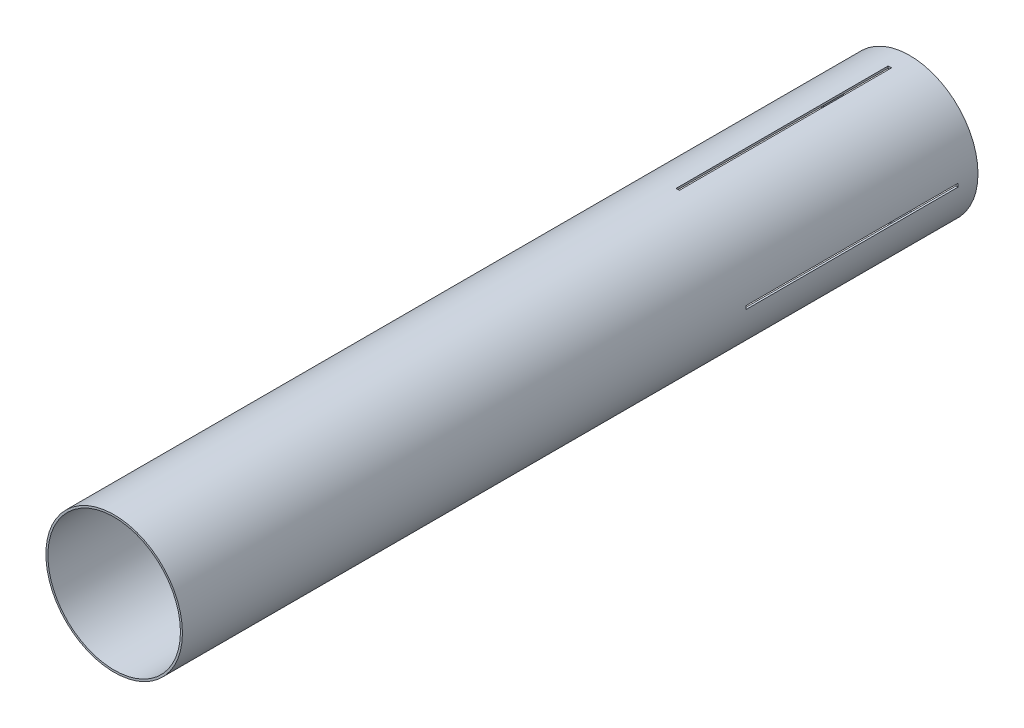
ISO-10303-21;
HEADER;
FILE_DESCRIPTION(('STEP AP214'),'2;1');
FILE_NAME('part.step','',(''),(''),'','','');
FILE_SCHEMA(('AUTOMOTIVE_DESIGN { 1 0 10303 214 1 1 1 1 }'));
ENDSEC;
DATA;
#1=APPLICATION_CONTEXT('core data for automotive mechanical design processes');
#2=APPLICATION_PROTOCOL_DEFINITION('international standard','automotive_design',2000,#1);
#3=PRODUCT_CONTEXT('',#1,'mechanical');
#4=PRODUCT('Part','Part','',(#3));
#5=PRODUCT_RELATED_PRODUCT_CATEGORY('part','',(#4));
#6=PRODUCT_DEFINITION_FORMATION('','',#4);
#7=PRODUCT_DEFINITION_CONTEXT('part definition',#1,'design');
#8=PRODUCT_DEFINITION('design','',#6,#7);
#9=PRODUCT_DEFINITION_SHAPE('','',#8);
#10=(LENGTH_UNIT() NAMED_UNIT(*) SI_UNIT(.MILLI.,.METRE.));
#11=(NAMED_UNIT(*) PLANE_ANGLE_UNIT() SI_UNIT($,.RADIAN.));
#12=(NAMED_UNIT(*) SI_UNIT($,.STERADIAN.) SOLID_ANGLE_UNIT());
#13=UNCERTAINTY_MEASURE_WITH_UNIT(LENGTH_MEASURE(1.E-05),#10,'distance_accuracy_value','');
#14=(GEOMETRIC_REPRESENTATION_CONTEXT(3) GLOBAL_UNCERTAINTY_ASSIGNED_CONTEXT((#13)) GLOBAL_UNIT_ASSIGNED_CONTEXT((#10,
#11,#12)) REPRESENTATION_CONTEXT('',''));
#15=CARTESIAN_POINT('',(0.,0.,0.));
#16=DIRECTION('',(0.,0.,1.));
#17=DIRECTION('',(1.,0.,0.));
#18=AXIS2_PLACEMENT_3D('',#15,#16,#17);
#19=CARTESIAN_POINT('',(0.,0.,381.));
#20=DIRECTION('',(0.,0.,-1.));
#21=DIRECTION('',(-1.,0.,0.));
#22=AXIS2_PLACEMENT_3D('',#19,#20,#21);
#23=CYLINDRICAL_SURFACE('',#22,65.405);
#24=CARTESIAN_POINT('',(0.,0.,-158.75));
#25=DIRECTION('',(0.,0.,-1.));
#26=DIRECTION('',(-1.,0.,0.));
#27=AXIS2_PLACEMENT_3D('',#24,#25,#26);
#28=CIRCLE('',#27,65.405);
#29=CARTESIAN_POINT('',(-65.3857313849895,-1.58750000000023,-158.75));
#30=VERTEX_POINT('',#29);
#31=CARTESIAN_POINT('',(-65.3857313849895,1.58749999999977,-158.75));
#32=VERTEX_POINT('',#31);
#33=EDGE_CURVE('E216',#30,#32,#28,.T.);
#34=ORIENTED_EDGE('',*,*,#33,.F.);
#35=DIRECTION('',(0.,0.,-1.));
#36=VECTOR('',#35,1.);
#37=CARTESIAN_POINT('',(-65.3857313849895,-1.58750000000023,381.));
#38=LINE('',#37,#36);
#39=CARTESIAN_POINT('',(-65.3857313849895,-1.58750000000022,-361.95));
#40=VERTEX_POINT('',#39);
#41=EDGE_CURVE('E239',#40,#30,#38,.F.);
#42=ORIENTED_EDGE('',*,*,#41,.F.);
#43=CARTESIAN_POINT('',(0.,0.,-361.95));
#44=DIRECTION('',(0.,0.,1.));
#45=DIRECTION('',(1.,0.,0.));
#46=AXIS2_PLACEMENT_3D('',#43,#44,#45);
#47=CIRCLE('',#46,65.405);
#48=CARTESIAN_POINT('',(-65.3857313849895,1.58749999999977,-361.95));
#49=VERTEX_POINT('',#48);
#50=EDGE_CURVE('E232',#49,#40,#47,.T.);
#51=ORIENTED_EDGE('',*,*,#50,.F.);
#52=DIRECTION('',(0.,0.,-1.));
#53=VECTOR('',#52,1.);
#54=CARTESIAN_POINT('',(-65.3857313849895,1.58749999999978,381.));
#55=LINE('',#54,#53);
#56=EDGE_CURVE('E236',#32,#49,#55,.T.);
#57=ORIENTED_EDGE('',*,*,#56,.F.);
#58=EDGE_LOOP('',(#34,#42,#51,#57));
#59=FACE_BOUND('',#58,.T.);
#60=CARTESIAN_POINT('',(1.5875,-65.3857313849895,-158.75));
#61=VERTEX_POINT('',#60);
#62=CARTESIAN_POINT('',(-1.5875,-65.3857313849895,-158.75));
#63=VERTEX_POINT('',#62);
#64=EDGE_CURVE('E240',#61,#63,#28,.T.);
#65=ORIENTED_EDGE('',*,*,#64,.F.);
#66=DIRECTION('',(0.,0.,-1.));
#67=VECTOR('',#66,1.);
#68=CARTESIAN_POINT('',(1.58750000000001,-65.3857313849895,381.));
#69=LINE('',#68,#67);
#70=CARTESIAN_POINT('',(1.58749999999999,-65.3857313849895,-361.95));
#71=VERTEX_POINT('',#70);
#72=EDGE_CURVE('E227',#71,#61,#69,.F.);
#73=ORIENTED_EDGE('',*,*,#72,.F.);
#74=CARTESIAN_POINT('',(-1.5875,-65.3857313849895,-361.95));
#75=VERTEX_POINT('',#74);
#76=EDGE_CURVE('E59',#75,#71,#47,.T.);
#77=ORIENTED_EDGE('',*,*,#76,.F.);
#78=DIRECTION('',(0.,0.,-1.));
#79=VECTOR('',#78,1.);
#80=CARTESIAN_POINT('',(-1.58750000000001,-65.3857313849895,381.));
#81=LINE('',#80,#79);
#82=EDGE_CURVE('E229',#63,#75,#81,.T.);
#83=ORIENTED_EDGE('',*,*,#82,.F.);
#84=EDGE_LOOP('',(#65,#73,#77,#83));
#85=FACE_BOUND('',#84,.T.);
#86=CARTESIAN_POINT('',(0.,0.,381.));
#87=DIRECTION('',(0.,0.,1.));
#88=DIRECTION('',(1.,0.,0.));
#89=AXIS2_PLACEMENT_3D('',#86,#87,#88);
#90=CIRCLE('',#89,65.405);
#91=CARTESIAN_POINT('',(65.405,0.,381.));
#92=VERTEX_POINT('',#91);
#93=EDGE_CURVE('E269',#92,#92,#90,.T.);
#94=ORIENTED_EDGE('',*,*,#93,.F.);
#95=EDGE_LOOP('',(#94));
#96=FACE_BOUND('',#95,.T.);
#97=CARTESIAN_POINT('',(0.,0.,-381.));
#98=DIRECTION('',(0.,0.,1.));
#99=DIRECTION('',(1.,0.,0.));
#100=AXIS2_PLACEMENT_3D('',#97,#98,#99);
#101=CIRCLE('',#100,65.405);
#102=CARTESIAN_POINT('',(65.405,0.,-381.));
#103=VERTEX_POINT('',#102);
#104=EDGE_CURVE('E266',#103,#103,#101,.T.);
#105=ORIENTED_EDGE('',*,*,#104,.T.);
#106=EDGE_LOOP('',(#105));
#107=FACE_BOUND('',#106,.T.);
#108=CARTESIAN_POINT('',(0.,0.,-361.95));
#109=DIRECTION('',(0.,0.,1.));
#110=DIRECTION('',(1.,0.,0.));
#111=AXIS2_PLACEMENT_3D('',#108,#109,#110);
#112=CIRCLE('',#111,65.405);
#113=CARTESIAN_POINT('',(1.5875,65.3857313849895,-361.95));
#114=VERTEX_POINT('',#113);
#115=CARTESIAN_POINT('',(-1.58749999999999,65.3857313849895,-361.95));
#116=VERTEX_POINT('',#115);
#117=EDGE_CURVE('E254',#114,#116,#112,.T.);
#118=ORIENTED_EDGE('',*,*,#117,.F.);
#119=DIRECTION('',(0.,0.,-1.));
#120=VECTOR('',#119,1.);
#121=CARTESIAN_POINT('',(1.58750000000001,65.3857313849895,381.));
#122=LINE('',#121,#120);
#123=CARTESIAN_POINT('',(1.5875,65.3857313849895,-158.75));
#124=VERTEX_POINT('',#123);
#125=EDGE_CURVE('E256',#124,#114,#122,.T.);
#126=ORIENTED_EDGE('',*,*,#125,.F.);
#127=CARTESIAN_POINT('',(0.,0.,-158.75));
#128=DIRECTION('',(0.,0.,-1.));
#129=DIRECTION('',(-1.,0.,0.));
#130=AXIS2_PLACEMENT_3D('',#127,#128,#129);
#131=CIRCLE('',#130,65.405);
#132=CARTESIAN_POINT('',(-1.5875,65.3857313849895,-158.75));
#133=VERTEX_POINT('',#132);
#134=EDGE_CURVE('E258',#133,#124,#131,.T.);
#135=ORIENTED_EDGE('',*,*,#134,.F.);
#136=DIRECTION('',(0.,0.,-1.));
#137=VECTOR('',#136,1.);
#138=CARTESIAN_POINT('',(-1.58750000000001,65.3857313849895,381.));
#139=LINE('',#138,#137);
#140=EDGE_CURVE('E260',#116,#133,#139,.F.);
#141=ORIENTED_EDGE('',*,*,#140,.F.);
#142=EDGE_LOOP('',(#118,#126,#135,#141));
#143=FACE_BOUND('',#142,.T.);
#144=CARTESIAN_POINT('',(65.3857313849895,1.58750000000023,-158.75));
#145=VERTEX_POINT('',#144);
#146=CARTESIAN_POINT('',(65.3857313849895,-1.58749999999932,-158.75));
#147=VERTEX_POINT('',#146);
#148=EDGE_CURVE('E67',#145,#147,#28,.T.);
#149=ORIENTED_EDGE('',*,*,#148,.F.);
#150=DIRECTION('',(0.,0.,-1.));
#151=VECTOR('',#150,1.);
#152=CARTESIAN_POINT('',(65.3857313849895,1.58750000000024,381.));
#153=LINE('',#152,#151);
#154=CARTESIAN_POINT('',(65.3857313849895,1.58750000000023,-361.95));
#155=VERTEX_POINT('',#154);
#156=EDGE_CURVE('E234',#155,#145,#153,.F.);
#157=ORIENTED_EDGE('',*,*,#156,.F.);
#158=CARTESIAN_POINT('',(65.3857313849895,-1.58749999999932,-361.95));
#159=VERTEX_POINT('',#158);
#160=EDGE_CURVE('E231',#159,#155,#47,.T.);
#161=ORIENTED_EDGE('',*,*,#160,.F.);
#162=DIRECTION('',(0.,0.,-1.));
#163=VECTOR('',#162,1.);
#164=CARTESIAN_POINT('',(65.3857313849895,-1.58749999999932,381.));
#165=LINE('',#164,#163);
#166=EDGE_CURVE('E220',#147,#159,#165,.T.);
#167=ORIENTED_EDGE('',*,*,#166,.F.);
#168=EDGE_LOOP('',(#149,#157,#161,#167));
#169=FACE_BOUND('',#168,.T.);
#170=ADVANCED_FACE('F45',(#59,#85,#96,#107,#143,#169),#23,.T.);
#171=CARTESIAN_POINT('',(0.,0.,381.));
#172=DIRECTION('',(0.,0.,-1.));
#173=DIRECTION('',(-1.,0.,0.));
#174=AXIS2_PLACEMENT_3D('',#171,#172,#173);
#175=CYLINDRICAL_SURFACE('',#174,63.5);
#176=CARTESIAN_POINT('',(0.,0.,381.));
#177=DIRECTION('',(0.,0.,1.));
#178=DIRECTION('',(1.,0.,0.));
#179=AXIS2_PLACEMENT_3D('',#176,#177,#178);
#180=CIRCLE('',#179,63.5);
#181=CARTESIAN_POINT('',(63.5,0.,381.));
#182=VERTEX_POINT('',#181);
#183=EDGE_CURVE('E263',#182,#182,#180,.T.);
#184=ORIENTED_EDGE('',*,*,#183,.T.);
#185=EDGE_LOOP('',(#184));
#186=FACE_BOUND('',#185,.T.);
#187=CARTESIAN_POINT('',(0.,0.,-381.));
#188=DIRECTION('',(0.,0.,1.));
#189=DIRECTION('',(1.,0.,0.));
#190=AXIS2_PLACEMENT_3D('',#187,#188,#189);
#191=CIRCLE('',#190,63.5);
#192=CARTESIAN_POINT('',(63.5,0.,-381.));
#193=VERTEX_POINT('',#192);
#194=EDGE_CURVE('E262',#193,#193,#191,.T.);
#195=ORIENTED_EDGE('',*,*,#194,.F.);
#196=EDGE_LOOP('',(#195));
#197=FACE_BOUND('',#196,.T.);
#198=CARTESIAN_POINT('',(0.,0.,-361.95));
#199=DIRECTION('',(0.,0.,1.));
#200=DIRECTION('',(1.,0.,0.));
#201=AXIS2_PLACEMENT_3D('',#198,#199,#200);
#202=CIRCLE('',#201,63.5);
#203=CARTESIAN_POINT('',(1.5875,63.4801531484448,-361.95));
#204=VERTEX_POINT('',#203);
#205=CARTESIAN_POINT('',(-1.58749999999999,63.4801531484448,-361.95));
#206=VERTEX_POINT('',#205);
#207=EDGE_CURVE('E272',#204,#206,#202,.T.);
#208=ORIENTED_EDGE('',*,*,#207,.T.);
#209=DIRECTION('',(0.,0.,-1.));
#210=VECTOR('',#209,1.);
#211=CARTESIAN_POINT('',(-1.58750000000001,63.4801531484448,381.));
#212=LINE('',#211,#210);
#213=CARTESIAN_POINT('',(-1.5875,63.4801531484448,-158.75));
#214=VERTEX_POINT('',#213);
#215=EDGE_CURVE('E172',#206,#214,#212,.F.);
#216=ORIENTED_EDGE('',*,*,#215,.T.);
#217=CARTESIAN_POINT('',(0.,0.,-158.75));
#218=DIRECTION('',(0.,0.,-1.));
#219=DIRECTION('',(-1.,0.,0.));
#220=AXIS2_PLACEMENT_3D('',#217,#218,#219);
#221=CIRCLE('',#220,63.5);
#222=CARTESIAN_POINT('',(1.5875,63.4801531484448,-158.75));
#223=VERTEX_POINT('',#222);
#224=EDGE_CURVE('E280',#214,#223,#221,.T.);
#225=ORIENTED_EDGE('',*,*,#224,.T.);
#226=DIRECTION('',(0.,0.,-1.));
#227=VECTOR('',#226,1.);
#228=CARTESIAN_POINT('',(1.58750000000001,63.4801531484448,381.));
#229=LINE('',#228,#227);
#230=EDGE_CURVE('E277',#223,#204,#229,.T.);
#231=ORIENTED_EDGE('',*,*,#230,.T.);
#232=EDGE_LOOP('',(#208,#216,#225,#231));
#233=FACE_BOUND('',#232,.T.);
#234=DIRECTION('',(0.,0.,-1.));
#235=VECTOR('',#234,1.);
#236=CARTESIAN_POINT('',(63.4801531484448,1.58750000000023,381.));
#237=LINE('',#236,#235);
#238=CARTESIAN_POINT('',(63.4801531484448,1.58750000000022,-361.95));
#239=VERTEX_POINT('',#238);
#240=CARTESIAN_POINT('',(63.4801531484448,1.58750000000022,-158.75));
#241=VERTEX_POINT('',#240);
#242=EDGE_CURVE('E182',#239,#241,#237,.F.);
#243=ORIENTED_EDGE('',*,*,#242,.T.);
#244=CARTESIAN_POINT('',(0.,0.,-158.75));
#245=DIRECTION('',(0.,0.,-1.));
#246=DIRECTION('',(-1.,0.,0.));
#247=AXIS2_PLACEMENT_3D('',#244,#245,#246);
#248=CIRCLE('',#247,63.5);
#249=CARTESIAN_POINT('',(63.4801531484448,-1.58749999999934,-158.75));
#250=VERTEX_POINT('',#249);
#251=EDGE_CURVE('E175',#241,#250,#248,.T.);
#252=ORIENTED_EDGE('',*,*,#251,.T.);
#253=DIRECTION('',(0.,0.,-1.));
#254=VECTOR('',#253,1.);
#255=CARTESIAN_POINT('',(63.4801531484448,-1.58749999999934,381.));
#256=LINE('',#255,#254);
#257=CARTESIAN_POINT('',(63.4801531484448,-1.58749999999934,-361.95));
#258=VERTEX_POINT('',#257);
#259=EDGE_CURVE('E160',#250,#258,#256,.T.);
#260=ORIENTED_EDGE('',*,*,#259,.T.);
#261=CARTESIAN_POINT('',(0.,0.,-361.95));
#262=DIRECTION('',(0.,0.,1.));
#263=DIRECTION('',(1.,0.,0.));
#264=AXIS2_PLACEMENT_3D('',#261,#262,#263);
#265=CIRCLE('',#264,63.5);
#266=EDGE_CURVE('E171',#258,#239,#265,.T.);
#267=ORIENTED_EDGE('',*,*,#266,.T.);
#268=EDGE_LOOP('',(#243,#252,#260,#267));
#269=FACE_BOUND('',#268,.T.);
#270=CARTESIAN_POINT('',(1.58750000000001,-63.4801531484448,-158.75));
#271=VERTEX_POINT('',#270);
#272=CARTESIAN_POINT('',(-1.5875,-63.4801531484448,-158.75));
#273=VERTEX_POINT('',#272);
#274=EDGE_CURVE('E185',#271,#273,#248,.T.);
#275=ORIENTED_EDGE('',*,*,#274,.T.);
#276=DIRECTION('',(0.,0.,-1.));
#277=VECTOR('',#276,1.);
#278=CARTESIAN_POINT('',(-1.58750000000001,-63.4801531484448,381.));
#279=LINE('',#278,#277);
#280=CARTESIAN_POINT('',(-1.5875,-63.4801531484448,-361.95));
#281=VERTEX_POINT('',#280);
#282=EDGE_CURVE('E193',#273,#281,#279,.T.);
#283=ORIENTED_EDGE('',*,*,#282,.T.);
#284=CARTESIAN_POINT('',(1.58749999999999,-63.4801531484448,-361.95));
#285=VERTEX_POINT('',#284);
#286=EDGE_CURVE('E187',#281,#285,#265,.T.);
#287=ORIENTED_EDGE('',*,*,#286,.T.);
#288=DIRECTION('',(0.,0.,-1.));
#289=VECTOR('',#288,1.);
#290=CARTESIAN_POINT('',(1.58750000000001,-63.4801531484448,381.));
#291=LINE('',#290,#289);
#292=EDGE_CURVE('E183',#285,#271,#291,.F.);
#293=ORIENTED_EDGE('',*,*,#292,.T.);
#294=EDGE_LOOP('',(#275,#283,#287,#293));
#295=FACE_BOUND('',#294,.T.);
#296=CARTESIAN_POINT('',(-63.4801531484448,1.58749999999978,-361.95));
#297=VERTEX_POINT('',#296);
#298=CARTESIAN_POINT('',(-63.4801531484448,-1.58750000000022,-361.95));
#299=VERTEX_POINT('',#298);
#300=EDGE_CURVE('E196',#297,#299,#265,.T.);
#301=ORIENTED_EDGE('',*,*,#300,.T.);
#302=DIRECTION('',(0.,0.,-1.));
#303=VECTOR('',#302,1.);
#304=CARTESIAN_POINT('',(-63.4801531484448,-1.58750000000023,381.));
#305=LINE('',#304,#303);
#306=CARTESIAN_POINT('',(-63.4801531484448,-1.58750000000022,-158.75));
#307=VERTEX_POINT('',#306);
#308=EDGE_CURVE('E11',#299,#307,#305,.F.);
#309=ORIENTED_EDGE('',*,*,#308,.T.);
#310=CARTESIAN_POINT('',(-63.4801531484448,1.58749999999978,-158.75));
#311=VERTEX_POINT('',#310);
#312=EDGE_CURVE('E52',#307,#311,#248,.T.);
#313=ORIENTED_EDGE('',*,*,#312,.T.);
#314=DIRECTION('',(0.,0.,-1.));
#315=VECTOR('',#314,1.);
#316=CARTESIAN_POINT('',(-63.4801531484448,1.58749999999978,381.));
#317=LINE('',#316,#315);
#318=EDGE_CURVE('E191',#311,#297,#317,.T.);
#319=ORIENTED_EDGE('',*,*,#318,.T.);
#320=EDGE_LOOP('',(#301,#309,#313,#319));
#321=FACE_BOUND('',#320,.T.);
#322=ADVANCED_FACE('F180',(#186,#197,#233,#269,#295,#321),#175,.F.);
#323=CARTESIAN_POINT('',(0.,0.,381.));
#324=DIRECTION('',(0.,0.,1.));
#325=DIRECTION('',(1.,0.,0.));
#326=AXIS2_PLACEMENT_3D('',#323,#324,#325);
#327=PLANE('',#326);
#328=ORIENTED_EDGE('',*,*,#93,.T.);
#329=EDGE_LOOP('',(#328));
#330=FACE_BOUND('',#329,.T.);
#331=ORIENTED_EDGE('',*,*,#183,.F.);
#332=EDGE_LOOP('',(#331));
#333=FACE_BOUND('',#332,.T.);
#334=ADVANCED_FACE('F320',(#330,#333),#327,.T.);
#335=CARTESIAN_POINT('',(0.,0.,-381.));
#336=DIRECTION('',(0.,0.,1.));
#337=DIRECTION('',(1.,0.,0.));
#338=AXIS2_PLACEMENT_3D('',#335,#336,#337);
#339=PLANE('',#338);
#340=ORIENTED_EDGE('',*,*,#104,.F.);
#341=EDGE_LOOP('',(#340));
#342=FACE_BOUND('',#341,.T.);
#343=ORIENTED_EDGE('',*,*,#194,.T.);
#344=EDGE_LOOP('',(#343));
#345=FACE_BOUND('',#344,.T.);
#346=ADVANCED_FACE('F333',(#342,#345),#339,.F.);
#347=CARTESIAN_POINT('',(-1.5875,65.405,-158.75));
#348=DIRECTION('',(1.,0.,0.));
#349=DIRECTION('',(0.,0.,-1.));
#350=AXIS2_PLACEMENT_3D('',#347,#348,#349);
#351=PLANE('',#350);
#352=ORIENTED_EDGE('',*,*,#140,.T.);
#353=DIRECTION('',(0.,-1.,0.));
#354=VECTOR('',#353,1.);
#355=CARTESIAN_POINT('',(-1.5875,65.405,-158.75));
#356=LINE('',#355,#354);
#357=EDGE_CURVE('E251',#133,#214,#356,.T.);
#358=ORIENTED_EDGE('',*,*,#357,.T.);
#359=ORIENTED_EDGE('',*,*,#215,.F.);
#360=DIRECTION('',(0.,-1.,0.));
#361=VECTOR('',#360,1.);
#362=CARTESIAN_POINT('',(-1.58749999999999,65.405,-361.95));
#363=LINE('',#362,#361);
#364=EDGE_CURVE('E243',#116,#206,#363,.T.);
#365=ORIENTED_EDGE('',*,*,#364,.F.);
#366=EDGE_LOOP('',(#352,#358,#359,#365));
#367=FACE_BOUND('',#366,.T.);
#368=ADVANCED_FACE('F288',(#367),#351,.T.);
#369=CARTESIAN_POINT('',(1.5875,65.405,-158.75));
#370=DIRECTION('',(0.,0.,-1.));
#371=DIRECTION('',(-1.,0.,0.));
#372=AXIS2_PLACEMENT_3D('',#369,#370,#371);
#373=PLANE('',#372);
#374=ORIENTED_EDGE('',*,*,#134,.T.);
#375=DIRECTION('',(0.,-1.,0.));
#376=VECTOR('',#375,1.);
#377=CARTESIAN_POINT('',(1.5875,65.405,-158.75));
#378=LINE('',#377,#376);
#379=EDGE_CURVE('E248',#124,#223,#378,.T.);
#380=ORIENTED_EDGE('',*,*,#379,.T.);
#381=ORIENTED_EDGE('',*,*,#224,.F.);
#382=ORIENTED_EDGE('',*,*,#357,.F.);
#383=EDGE_LOOP('',(#374,#380,#381,#382));
#384=FACE_BOUND('',#383,.T.);
#385=ADVANCED_FACE('F293',(#384),#373,.T.);
#386=CARTESIAN_POINT('',(1.5875,65.405,-158.75));
#387=DIRECTION('',(-1.,0.,0.));
#388=DIRECTION('',(0.,0.,1.));
#389=AXIS2_PLACEMENT_3D('',#386,#387,#388);
#390=PLANE('',#389);
#391=ORIENTED_EDGE('',*,*,#125,.T.);
#392=DIRECTION('',(0.,-1.,0.));
#393=VECTOR('',#392,1.);
#394=CARTESIAN_POINT('',(1.5875,65.405,-361.95));
#395=LINE('',#394,#393);
#396=EDGE_CURVE('E245',#114,#204,#395,.T.);
#397=ORIENTED_EDGE('',*,*,#396,.T.);
#398=ORIENTED_EDGE('',*,*,#230,.F.);
#399=ORIENTED_EDGE('',*,*,#379,.F.);
#400=EDGE_LOOP('',(#391,#397,#398,#399));
#401=FACE_BOUND('',#400,.T.);
#402=ADVANCED_FACE('F301',(#401),#390,.T.);
#403=CARTESIAN_POINT('',(1.5875,65.405,-361.95));
#404=DIRECTION('',(0.,0.,1.));
#405=DIRECTION('',(1.,0.,0.));
#406=AXIS2_PLACEMENT_3D('',#403,#404,#405);
#407=PLANE('',#406);
#408=ORIENTED_EDGE('',*,*,#117,.T.);
#409=ORIENTED_EDGE('',*,*,#364,.T.);
#410=ORIENTED_EDGE('',*,*,#207,.F.);
#411=ORIENTED_EDGE('',*,*,#396,.F.);
#412=EDGE_LOOP('',(#408,#409,#410,#411));
#413=FACE_BOUND('',#412,.T.);
#414=ADVANCED_FACE('F303',(#413),#407,.T.);
#415=CARTESIAN_POINT('',(65.4050000000007,-1.58749999999932,-158.75));
#416=DIRECTION('',(0.,1.,0.));
#417=DIRECTION('',(-1.,0.,0.));
#418=AXIS2_PLACEMENT_3D('',#415,#416,#417);
#419=PLANE('',#418);
#420=ORIENTED_EDGE('',*,*,#166,.T.);
#421=DIRECTION('',(-1.,0.,0.));
#422=VECTOR('',#421,1.);
#423=CARTESIAN_POINT('',(65.4050000000007,-1.58749999999932,-361.95));
#424=LINE('',#423,#422);
#425=EDGE_CURVE('E166',#159,#258,#424,.T.);
#426=ORIENTED_EDGE('',*,*,#425,.T.);
#427=ORIENTED_EDGE('',*,*,#259,.F.);
#428=DIRECTION('',(-1.,0.,0.));
#429=VECTOR('',#428,1.);
#430=CARTESIAN_POINT('',(65.4050000000007,-1.58749999999932,-158.75));
#431=LINE('',#430,#429);
#432=EDGE_CURVE('E163',#147,#250,#431,.T.);
#433=ORIENTED_EDGE('',*,*,#432,.F.);
#434=EDGE_LOOP('',(#420,#426,#427,#433));
#435=FACE_BOUND('',#434,.T.);
#436=ADVANCED_FACE('F162',(#435),#419,.T.);
#437=CARTESIAN_POINT('',(-65.4050000000002,1.58749999999977,-361.95));
#438=DIRECTION('',(0.,0.,1.));
#439=DIRECTION('',(1.,0.,0.));
#440=AXIS2_PLACEMENT_3D('',#437,#438,#439);
#441=PLANE('',#440);
#442=ORIENTED_EDGE('',*,*,#160,.T.);
#443=DIRECTION('',(1.,0.,0.));
#444=VECTOR('',#443,1.);
#445=CARTESIAN_POINT('',(-65.4050000000002,1.58749999999977,-361.95));
#446=LINE('',#445,#444);
#447=EDGE_CURVE('E223',#239,#155,#446,.T.);
#448=ORIENTED_EDGE('',*,*,#447,.F.);
#449=ORIENTED_EDGE('',*,*,#266,.F.);
#450=ORIENTED_EDGE('',*,*,#425,.F.);
#451=EDGE_LOOP('',(#442,#448,#449,#450));
#452=FACE_BOUND('',#451,.T.);
#453=ADVANCED_FACE('F311',(#452),#441,.T.);
#454=CARTESIAN_POINT('',(-65.4050000000002,1.58749999999977,-158.75));
#455=DIRECTION('',(0.,-1.,0.));
#456=DIRECTION('',(1.,0.,0.));
#457=AXIS2_PLACEMENT_3D('',#454,#455,#456);
#458=PLANE('',#457);
#459=ORIENTED_EDGE('',*,*,#156,.T.);
#460=DIRECTION('',(1.,0.,0.));
#461=VECTOR('',#460,1.);
#462=CARTESIAN_POINT('',(-65.4050000000002,1.58749999999977,-158.75));
#463=LINE('',#462,#461);
#464=EDGE_CURVE('E218',#241,#145,#463,.T.);
#465=ORIENTED_EDGE('',*,*,#464,.F.);
#466=ORIENTED_EDGE('',*,*,#242,.F.);
#467=ORIENTED_EDGE('',*,*,#447,.T.);
#468=EDGE_LOOP('',(#459,#465,#466,#467));
#469=FACE_BOUND('',#468,.T.);
#470=ADVANCED_FACE('F391',(#469),#458,.T.);
#471=CARTESIAN_POINT('',(-65.4050000000002,1.58749999999977,-158.75));
#472=DIRECTION('',(0.,0.,-1.));
#473=DIRECTION('',(-1.,0.,0.));
#474=AXIS2_PLACEMENT_3D('',#471,#472,#473);
#475=PLANE('',#474);
#476=ORIENTED_EDGE('',*,*,#148,.T.);
#477=ORIENTED_EDGE('',*,*,#432,.T.);
#478=ORIENTED_EDGE('',*,*,#251,.F.);
#479=ORIENTED_EDGE('',*,*,#464,.T.);
#480=EDGE_LOOP('',(#476,#477,#478,#479));
#481=FACE_BOUND('',#480,.T.);
#482=ADVANCED_FACE('F174',(#481),#475,.T.);
#483=CARTESIAN_POINT('',(1.5875,-65.405,-158.75));
#484=DIRECTION('',(-1.,0.,0.));
#485=DIRECTION('',(0.,0.,1.));
#486=AXIS2_PLACEMENT_3D('',#483,#484,#485);
#487=PLANE('',#486);
#488=ORIENTED_EDGE('',*,*,#72,.T.);
#489=DIRECTION('',(0.,1.,0.));
#490=VECTOR('',#489,1.);
#491=CARTESIAN_POINT('',(1.5875,-65.405,-158.75));
#492=LINE('',#491,#490);
#493=EDGE_CURVE('E527',#61,#271,#492,.T.);
#494=ORIENTED_EDGE('',*,*,#493,.T.);
#495=ORIENTED_EDGE('',*,*,#292,.F.);
#496=DIRECTION('',(0.,1.,0.));
#497=VECTOR('',#496,1.);
#498=CARTESIAN_POINT('',(1.58749999999999,-65.405,-361.95));
#499=LINE('',#498,#497);
#500=EDGE_CURVE('E177',#71,#285,#499,.T.);
#501=ORIENTED_EDGE('',*,*,#500,.F.);
#502=EDGE_LOOP('',(#488,#494,#495,#501));
#503=FACE_BOUND('',#502,.T.);
#504=ADVANCED_FACE('F421',(#503),#487,.T.);
#505=CARTESIAN_POINT('',(-1.5875,-65.405,-158.75));
#506=DIRECTION('',(1.,0.,0.));
#507=DIRECTION('',(0.,0.,-1.));
#508=AXIS2_PLACEMENT_3D('',#505,#506,#507);
#509=PLANE('',#508);
#510=ORIENTED_EDGE('',*,*,#82,.T.);
#511=DIRECTION('',(0.,1.,0.));
#512=VECTOR('',#511,1.);
#513=CARTESIAN_POINT('',(-1.5875,-65.405,-361.95));
#514=LINE('',#513,#512);
#515=EDGE_CURVE('E534',#75,#281,#514,.T.);
#516=ORIENTED_EDGE('',*,*,#515,.T.);
#517=ORIENTED_EDGE('',*,*,#282,.F.);
#518=DIRECTION('',(0.,1.,0.));
#519=VECTOR('',#518,1.);
#520=CARTESIAN_POINT('',(-1.5875,-65.405,-158.75));
#521=LINE('',#520,#519);
#522=EDGE_CURVE('E529',#63,#273,#521,.T.);
#523=ORIENTED_EDGE('',*,*,#522,.F.);
#524=EDGE_LOOP('',(#510,#516,#517,#523));
#525=FACE_BOUND('',#524,.T.);
#526=ADVANCED_FACE('F437',(#525),#509,.T.);
#527=ORIENTED_EDGE('',*,*,#76,.T.);
#528=ORIENTED_EDGE('',*,*,#500,.T.);
#529=ORIENTED_EDGE('',*,*,#286,.F.);
#530=ORIENTED_EDGE('',*,*,#515,.F.);
#531=EDGE_LOOP('',(#527,#528,#529,#530));
#532=FACE_BOUND('',#531,.T.);
#533=ADVANCED_FACE('F395',(#532),#441,.T.);
#534=ORIENTED_EDGE('',*,*,#64,.T.);
#535=ORIENTED_EDGE('',*,*,#522,.T.);
#536=ORIENTED_EDGE('',*,*,#274,.F.);
#537=ORIENTED_EDGE('',*,*,#493,.F.);
#538=EDGE_LOOP('',(#534,#535,#536,#537));
#539=FACE_BOUND('',#538,.T.);
#540=ADVANCED_FACE('F423',(#539),#475,.T.);
#541=CARTESIAN_POINT('',(-65.4050000000002,-1.58750000000023,-158.75));
#542=DIRECTION('',(0.,1.,0.));
#543=DIRECTION('',(-1.,0.,0.));
#544=AXIS2_PLACEMENT_3D('',#541,#542,#543);
#545=PLANE('',#544);
#546=ORIENTED_EDGE('',*,*,#41,.T.);
#547=DIRECTION('',(1.,0.,0.));
#548=VECTOR('',#547,1.);
#549=CARTESIAN_POINT('',(-65.4050000000002,-1.58750000000023,-158.75));
#550=LINE('',#549,#548);
#551=EDGE_CURVE('E217',#30,#307,#550,.T.);
#552=ORIENTED_EDGE('',*,*,#551,.T.);
#553=ORIENTED_EDGE('',*,*,#308,.F.);
#554=DIRECTION('',(1.,0.,0.));
#555=VECTOR('',#554,1.);
#556=CARTESIAN_POINT('',(-65.4050000000002,-1.58750000000022,-361.95));
#557=LINE('',#556,#555);
#558=EDGE_CURVE('E525',#40,#299,#557,.T.);
#559=ORIENTED_EDGE('',*,*,#558,.F.);
#560=EDGE_LOOP('',(#546,#552,#553,#559));
#561=FACE_BOUND('',#560,.T.);
#562=ADVANCED_FACE('F469',(#561),#545,.T.);
#563=ORIENTED_EDGE('',*,*,#33,.T.);
#564=EDGE_CURVE('E208',#32,#311,#463,.T.);
#565=ORIENTED_EDGE('',*,*,#564,.T.);
#566=ORIENTED_EDGE('',*,*,#312,.F.);
#567=ORIENTED_EDGE('',*,*,#551,.F.);
#568=EDGE_LOOP('',(#563,#565,#566,#567));
#569=FACE_BOUND('',#568,.T.);
#570=ADVANCED_FACE('F213',(#569),#475,.T.);
#571=ORIENTED_EDGE('',*,*,#56,.T.);
#572=EDGE_CURVE('E211',#49,#297,#446,.T.);
#573=ORIENTED_EDGE('',*,*,#572,.T.);
#574=ORIENTED_EDGE('',*,*,#318,.F.);
#575=ORIENTED_EDGE('',*,*,#564,.F.);
#576=EDGE_LOOP('',(#571,#573,#574,#575));
#577=FACE_BOUND('',#576,.T.);
#578=ADVANCED_FACE('F207',(#577),#458,.T.);
#579=ORIENTED_EDGE('',*,*,#50,.T.);
#580=ORIENTED_EDGE('',*,*,#558,.T.);
#581=ORIENTED_EDGE('',*,*,#300,.F.);
#582=ORIENTED_EDGE('',*,*,#572,.F.);
#583=EDGE_LOOP('',(#579,#580,#581,#582));
#584=FACE_BOUND('',#583,.T.);
#585=ADVANCED_FACE('F394',(#584),#441,.T.);
#586=CLOSED_SHELL('',(#170,#322,#334,#346,#368,#385,#402,#414,#436,#453,#470,#482,#504,#526,
#533,#540,#562,#570,#578,#585));
#587=MANIFOLD_SOLID_BREP('B2',#586);
#588=ADVANCED_BREP_SHAPE_REPRESENTATION('',(#18,#587),#14);
#589=SHAPE_DEFINITION_REPRESENTATION(#9,#588);
ENDSEC;
END-ISO-10303-21;
